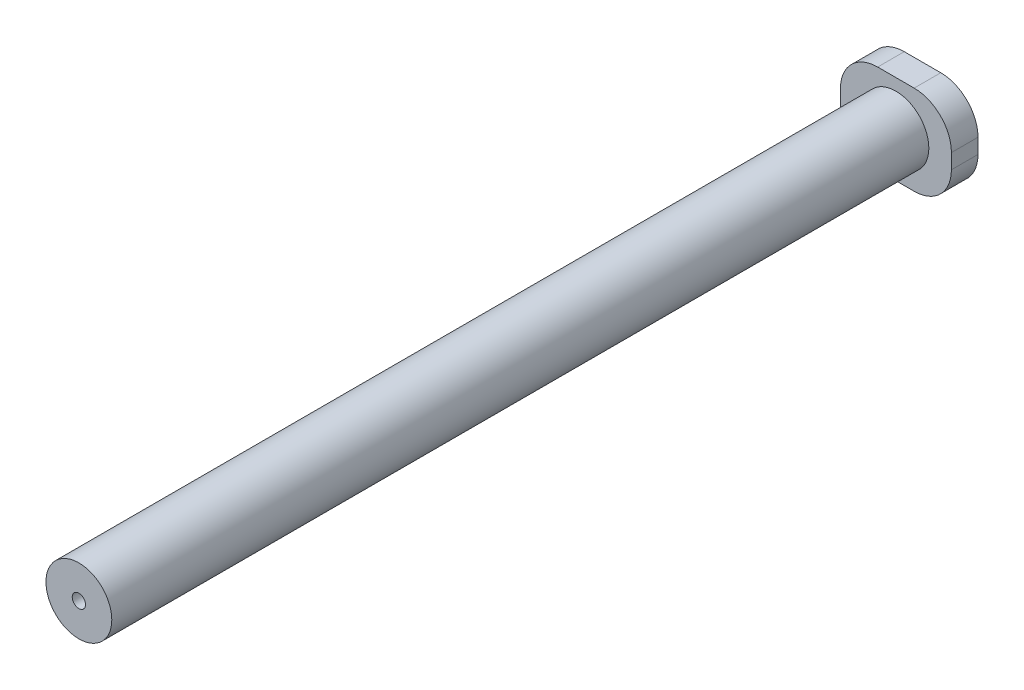
ISO-10303-21;
HEADER;
FILE_DESCRIPTION(('STEP AP214'),'2;1');
FILE_NAME('part.step','',(''),(''),'','','');
FILE_SCHEMA(('AUTOMOTIVE_DESIGN { 1 0 10303 214 1 1 1 1 }'));
ENDSEC;
DATA;
#1=APPLICATION_CONTEXT('core data for automotive mechanical design processes');
#2=APPLICATION_PROTOCOL_DEFINITION('international standard','automotive_design',2000,#1);
#3=PRODUCT_CONTEXT('',#1,'mechanical');
#4=PRODUCT('Part','Part','',(#3));
#5=PRODUCT_RELATED_PRODUCT_CATEGORY('part','',(#4));
#6=PRODUCT_DEFINITION_FORMATION('','',#4);
#7=PRODUCT_DEFINITION_CONTEXT('part definition',#1,'design');
#8=PRODUCT_DEFINITION('design','',#6,#7);
#9=PRODUCT_DEFINITION_SHAPE('','',#8);
#10=(LENGTH_UNIT() NAMED_UNIT(*) SI_UNIT(.MILLI.,.METRE.));
#11=(NAMED_UNIT(*) PLANE_ANGLE_UNIT() SI_UNIT($,.RADIAN.));
#12=(NAMED_UNIT(*) SI_UNIT($,.STERADIAN.) SOLID_ANGLE_UNIT());
#13=UNCERTAINTY_MEASURE_WITH_UNIT(LENGTH_MEASURE(1.E-05),#10,'distance_accuracy_value','');
#14=(GEOMETRIC_REPRESENTATION_CONTEXT(3) GLOBAL_UNCERTAINTY_ASSIGNED_CONTEXT((#13)) GLOBAL_UNIT_ASSIGNED_CONTEXT((#10,
#11,#12)) REPRESENTATION_CONTEXT('',''));
#15=CARTESIAN_POINT('',(0.,0.,0.));
#16=DIRECTION('',(0.,0.,1.));
#17=DIRECTION('',(1.,0.,0.));
#18=AXIS2_PLACEMENT_3D('',#15,#16,#17);
#19=CARTESIAN_POINT('',(0.,0.,3.175));
#20=DIRECTION('',(0.,1.,0.));
#21=DIRECTION('',(0.,0.,1.));
#22=AXIS2_PLACEMENT_3D('',#19,#20,#21);
#23=PLANE('',#22);
#24=DIRECTION('',(1.,0.,0.));
#25=VECTOR('',#24,1.);
#26=CARTESIAN_POINT('',(0.,0.,3.175));
#27=LINE('',#26,#25);
#28=CARTESIAN_POINT('',(4.445,0.,3.175));
#29=VERTEX_POINT('',#28);
#30=CARTESIAN_POINT('',(8.8011,0.,3.175));
#31=VERTEX_POINT('',#30);
#32=EDGE_CURVE('E124',#29,#31,#27,.T.);
#33=ORIENTED_EDGE('',*,*,#32,.F.);
#34=DIRECTION('',(0.,0.,-1.));
#35=VECTOR('',#34,1.);
#36=CARTESIAN_POINT('',(4.445,0.,0.));
#37=LINE('',#36,#35);
#38=CARTESIAN_POINT('',(4.445,0.,0.));
#39=VERTEX_POINT('',#38);
#40=EDGE_CURVE('E109',#29,#39,#37,.T.);
#41=ORIENTED_EDGE('',*,*,#40,.T.);
#42=DIRECTION('',(1.,0.,0.));
#43=VECTOR('',#42,1.);
#44=CARTESIAN_POINT('',(0.,0.,0.));
#45=LINE('',#44,#43);
#46=CARTESIAN_POINT('',(8.8011,0.,0.));
#47=VERTEX_POINT('',#46);
#48=EDGE_CURVE('E121',#39,#47,#45,.T.);
#49=ORIENTED_EDGE('',*,*,#48,.T.);
#50=DIRECTION('',(0.,0.,-1.));
#51=VECTOR('',#50,1.);
#52=CARTESIAN_POINT('',(8.8011,0.,3.175));
#53=LINE('',#52,#51);
#54=EDGE_CURVE('E126',#47,#31,#53,.F.);
#55=ORIENTED_EDGE('',*,*,#54,.T.);
#56=EDGE_LOOP('',(#33,#41,#49,#55));
#57=FACE_BOUND('',#56,.T.);
#58=ADVANCED_FACE('F39',(#57),#23,.F.);
#59=CARTESIAN_POINT('',(13.2461,0.,3.175));
#60=DIRECTION('',(-1.,0.,0.));
#61=DIRECTION('',(0.,0.,1.));
#62=AXIS2_PLACEMENT_3D('',#59,#60,#61);
#63=PLANE('',#62);
#64=DIRECTION('',(0.,1.,0.));
#65=VECTOR('',#64,1.);
#66=CARTESIAN_POINT('',(13.2461,0.,3.175));
#67=LINE('',#66,#65);
#68=CARTESIAN_POINT('',(13.2461,4.445,3.175));
#69=VERTEX_POINT('',#68);
#70=CARTESIAN_POINT('',(13.2461,6.223,3.175));
#71=VERTEX_POINT('',#70);
#72=EDGE_CURVE('E173',#69,#71,#67,.T.);
#73=ORIENTED_EDGE('',*,*,#72,.F.);
#74=DIRECTION('',(0.,0.,-1.));
#75=VECTOR('',#74,1.);
#76=CARTESIAN_POINT('',(13.2461,4.445,3.175));
#77=LINE('',#76,#75);
#78=CARTESIAN_POINT('',(13.2461,4.445,0.));
#79=VERTEX_POINT('',#78);
#80=EDGE_CURVE('E166',#69,#79,#77,.T.);
#81=ORIENTED_EDGE('',*,*,#80,.T.);
#82=DIRECTION('',(0.,1.,0.));
#83=VECTOR('',#82,1.);
#84=CARTESIAN_POINT('',(13.2461,0.,0.));
#85=LINE('',#84,#83);
#86=CARTESIAN_POINT('',(13.2461,6.223,0.));
#87=VERTEX_POINT('',#86);
#88=EDGE_CURVE('E131',#79,#87,#85,.T.);
#89=ORIENTED_EDGE('',*,*,#88,.T.);
#90=DIRECTION('',(0.,0.,-1.));
#91=VECTOR('',#90,1.);
#92=CARTESIAN_POINT('',(13.2461,6.223,3.175));
#93=LINE('',#92,#91);
#94=EDGE_CURVE('E164',#87,#71,#93,.F.);
#95=ORIENTED_EDGE('',*,*,#94,.T.);
#96=EDGE_LOOP('',(#73,#81,#89,#95));
#97=FACE_BOUND('',#96,.T.);
#98=ADVANCED_FACE('F171',(#97),#63,.F.);
#99=CARTESIAN_POINT('',(0.,10.668,3.175));
#100=DIRECTION('',(0.,1.,0.));
#101=DIRECTION('',(0.,0.,1.));
#102=AXIS2_PLACEMENT_3D('',#99,#100,#101);
#103=PLANE('',#102);
#104=DIRECTION('',(1.,0.,0.));
#105=VECTOR('',#104,1.);
#106=CARTESIAN_POINT('',(0.,10.668,3.175));
#107=LINE('',#106,#105);
#108=CARTESIAN_POINT('',(4.445,10.668,3.175));
#109=VERTEX_POINT('',#108);
#110=CARTESIAN_POINT('',(8.8011,10.668,3.175));
#111=VERTEX_POINT('',#110);
#112=EDGE_CURVE('E180',#109,#111,#107,.T.);
#113=ORIENTED_EDGE('',*,*,#112,.T.);
#114=DIRECTION('',(0.,0.,-1.));
#115=VECTOR('',#114,1.);
#116=CARTESIAN_POINT('',(8.8011,10.668,0.));
#117=LINE('',#116,#115);
#118=CARTESIAN_POINT('',(8.8011,10.668,0.));
#119=VERTEX_POINT('',#118);
#120=EDGE_CURVE('E11',#111,#119,#117,.T.);
#121=ORIENTED_EDGE('',*,*,#120,.T.);
#122=DIRECTION('',(1.,0.,0.));
#123=VECTOR('',#122,1.);
#124=CARTESIAN_POINT('',(0.,10.668,0.));
#125=LINE('',#124,#123);
#126=CARTESIAN_POINT('',(4.445,10.668,0.));
#127=VERTEX_POINT('',#126);
#128=EDGE_CURVE('E135',#127,#119,#125,.T.);
#129=ORIENTED_EDGE('',*,*,#128,.F.);
#130=DIRECTION('',(0.,0.,-1.));
#131=VECTOR('',#130,1.);
#132=CARTESIAN_POINT('',(4.445,10.668,3.175));
#133=LINE('',#132,#131);
#134=EDGE_CURVE('E47',#127,#109,#133,.F.);
#135=ORIENTED_EDGE('',*,*,#134,.T.);
#136=EDGE_LOOP('',(#113,#121,#129,#135));
#137=FACE_BOUND('',#136,.T.);
#138=ADVANCED_FACE('F179',(#137),#103,.T.);
#139=CARTESIAN_POINT('',(0.,0.,3.175));
#140=DIRECTION('',(-1.,0.,0.));
#141=DIRECTION('',(0.,0.,1.));
#142=AXIS2_PLACEMENT_3D('',#139,#140,#141);
#143=PLANE('',#142);
#144=DIRECTION('',(0.,1.,0.));
#145=VECTOR('',#144,1.);
#146=CARTESIAN_POINT('',(0.,0.,0.));
#147=LINE('',#146,#145);
#148=CARTESIAN_POINT('',(0.,4.445,0.));
#149=VERTEX_POINT('',#148);
#150=CARTESIAN_POINT('',(0.,6.223,0.));
#151=VERTEX_POINT('',#150);
#152=EDGE_CURVE('E146',#149,#151,#147,.T.);
#153=ORIENTED_EDGE('',*,*,#152,.F.);
#154=DIRECTION('',(0.,0.,-1.));
#155=VECTOR('',#154,1.);
#156=CARTESIAN_POINT('',(0.,4.445,3.175));
#157=LINE('',#156,#155);
#158=CARTESIAN_POINT('',(0.,4.445,3.175));
#159=VERTEX_POINT('',#158);
#160=EDGE_CURVE('E110',#149,#159,#157,.F.);
#161=ORIENTED_EDGE('',*,*,#160,.T.);
#162=DIRECTION('',(0.,1.,0.));
#163=VECTOR('',#162,1.);
#164=CARTESIAN_POINT('',(0.,0.,3.175));
#165=LINE('',#164,#163);
#166=CARTESIAN_POINT('',(0.,6.223,3.175));
#167=VERTEX_POINT('',#166);
#168=EDGE_CURVE('E141',#159,#167,#165,.T.);
#169=ORIENTED_EDGE('',*,*,#168,.T.);
#170=DIRECTION('',(0.,0.,-1.));
#171=VECTOR('',#170,1.);
#172=CARTESIAN_POINT('',(0.,6.223,3.175));
#173=LINE('',#172,#171);
#174=EDGE_CURVE('E115',#167,#151,#173,.T.);
#175=ORIENTED_EDGE('',*,*,#174,.T.);
#176=EDGE_LOOP('',(#153,#161,#169,#175));
#177=FACE_BOUND('',#176,.T.);
#178=ADVANCED_FACE('F234',(#177),#143,.T.);
#179=CARTESIAN_POINT('',(0.,0.,3.175));
#180=DIRECTION('',(0.,0.,1.));
#181=DIRECTION('',(1.,0.,0.));
#182=AXIS2_PLACEMENT_3D('',#179,#180,#181);
#183=PLANE('',#182);
#184=CARTESIAN_POINT('',(6.62305,5.334,3.175));
#185=DIRECTION('',(0.,0.,1.));
#186=DIRECTION('',(1.,0.,0.));
#187=AXIS2_PLACEMENT_3D('',#184,#185,#186);
#188=CIRCLE('',#187,3.93065);
#189=CARTESIAN_POINT('',(10.5537,5.334,3.175));
#190=VERTEX_POINT('',#189);
#191=EDGE_CURVE('E148',#190,#190,#188,.T.);
#192=ORIENTED_EDGE('',*,*,#191,.F.);
#193=EDGE_LOOP('',(#192));
#194=FACE_BOUND('',#193,.T.);
#195=ORIENTED_EDGE('',*,*,#168,.F.);
#196=CARTESIAN_POINT('',(4.445,4.445,3.175));
#197=DIRECTION('',(0.,0.,1.));
#198=DIRECTION('',(1.,0.,0.));
#199=AXIS2_PLACEMENT_3D('',#196,#197,#198);
#200=CIRCLE('',#199,4.445);
#201=EDGE_CURVE('E162',#159,#29,#200,.T.);
#202=ORIENTED_EDGE('',*,*,#201,.T.);
#203=ORIENTED_EDGE('',*,*,#32,.T.);
#204=CARTESIAN_POINT('',(8.8011,4.445,3.175));
#205=DIRECTION('',(0.,0.,1.));
#206=DIRECTION('',(1.,0.,0.));
#207=AXIS2_PLACEMENT_3D('',#204,#205,#206);
#208=CIRCLE('',#207,4.445);
#209=EDGE_CURVE('E160',#31,#69,#208,.T.);
#210=ORIENTED_EDGE('',*,*,#209,.T.);
#211=ORIENTED_EDGE('',*,*,#72,.T.);
#212=CARTESIAN_POINT('',(8.8011,6.223,3.175));
#213=DIRECTION('',(0.,0.,1.));
#214=DIRECTION('',(1.,0.,0.));
#215=AXIS2_PLACEMENT_3D('',#212,#213,#214);
#216=CIRCLE('',#215,4.445);
#217=EDGE_CURVE('E54',#71,#111,#216,.T.);
#218=ORIENTED_EDGE('',*,*,#217,.T.);
#219=ORIENTED_EDGE('',*,*,#112,.F.);
#220=CARTESIAN_POINT('',(4.445,6.223,3.175));
#221=DIRECTION('',(0.,0.,1.));
#222=DIRECTION('',(1.,0.,0.));
#223=AXIS2_PLACEMENT_3D('',#220,#221,#222);
#224=CIRCLE('',#223,4.445);
#225=EDGE_CURVE('E157',#109,#167,#224,.T.);
#226=ORIENTED_EDGE('',*,*,#225,.T.);
#227=EDGE_LOOP('',(#195,#202,#203,#210,#211,#218,#219,#226));
#228=FACE_BOUND('',#227,.T.);
#229=ADVANCED_FACE('F232',(#194,#228),#183,.T.);
#230=CARTESIAN_POINT('',(0.,0.,0.));
#231=DIRECTION('',(0.,0.,1.));
#232=DIRECTION('',(1.,0.,0.));
#233=AXIS2_PLACEMENT_3D('',#230,#231,#232);
#234=PLANE('',#233);
#235=ORIENTED_EDGE('',*,*,#48,.F.);
#236=CARTESIAN_POINT('',(4.445,4.445,0.));
#237=DIRECTION('',(0.,0.,1.));
#238=DIRECTION('',(1.,0.,0.));
#239=AXIS2_PLACEMENT_3D('',#236,#237,#238);
#240=CIRCLE('',#239,4.445);
#241=EDGE_CURVE('E105',#39,#149,#240,.F.);
#242=ORIENTED_EDGE('',*,*,#241,.T.);
#243=ORIENTED_EDGE('',*,*,#152,.T.);
#244=CARTESIAN_POINT('',(4.445,6.223,0.));
#245=DIRECTION('',(0.,0.,1.));
#246=DIRECTION('',(1.,0.,0.));
#247=AXIS2_PLACEMENT_3D('',#244,#245,#246);
#248=CIRCLE('',#247,4.445);
#249=EDGE_CURVE('E125',#151,#127,#248,.F.);
#250=ORIENTED_EDGE('',*,*,#249,.T.);
#251=ORIENTED_EDGE('',*,*,#128,.T.);
#252=CARTESIAN_POINT('',(8.8011,6.223,0.));
#253=DIRECTION('',(0.,0.,1.));
#254=DIRECTION('',(1.,0.,0.));
#255=AXIS2_PLACEMENT_3D('',#252,#253,#254);
#256=CIRCLE('',#255,4.445);
#257=EDGE_CURVE('E151',#119,#87,#256,.F.);
#258=ORIENTED_EDGE('',*,*,#257,.T.);
#259=ORIENTED_EDGE('',*,*,#88,.F.);
#260=CARTESIAN_POINT('',(8.8011,4.445,0.));
#261=DIRECTION('',(0.,0.,1.));
#262=DIRECTION('',(1.,0.,0.));
#263=AXIS2_PLACEMENT_3D('',#260,#261,#262);
#264=CIRCLE('',#263,4.445);
#265=EDGE_CURVE('E116',#79,#47,#264,.F.);
#266=ORIENTED_EDGE('',*,*,#265,.T.);
#267=EDGE_LOOP('',(#235,#242,#243,#250,#251,#258,#259,#266));
#268=FACE_BOUND('',#267,.T.);
#269=CARTESIAN_POINT('',(6.62305,5.334,0.));
#270=DIRECTION('',(0.,0.,1.));
#271=DIRECTION('',(1.,0.,0.));
#272=AXIS2_PLACEMENT_3D('',#269,#270,#271);
#273=CIRCLE('',#272,0.79375);
#274=CARTESIAN_POINT('',(7.4168,5.334,0.));
#275=VERTEX_POINT('',#274);
#276=EDGE_CURVE('E188',#275,#275,#273,.T.);
#277=ORIENTED_EDGE('',*,*,#276,.T.);
#278=EDGE_LOOP('',(#277));
#279=FACE_BOUND('',#278,.T.);
#280=ADVANCED_FACE('F128',(#268,#279),#234,.F.);
#281=CARTESIAN_POINT('',(6.62305,5.334,100.711));
#282=DIRECTION('',(0.,0.,-1.));
#283=DIRECTION('',(-1.,0.,0.));
#284=AXIS2_PLACEMENT_3D('',#281,#282,#283);
#285=CYLINDRICAL_SURFACE('',#284,0.79375);
#286=CARTESIAN_POINT('',(6.62305,5.334,100.711));
#287=DIRECTION('',(0.,0.,1.));
#288=DIRECTION('',(1.,0.,0.));
#289=AXIS2_PLACEMENT_3D('',#286,#287,#288);
#290=CIRCLE('',#289,0.79375);
#291=CARTESIAN_POINT('',(7.4168,5.334,100.711));
#292=VERTEX_POINT('',#291);
#293=EDGE_CURVE('E138',#292,#292,#290,.T.);
#294=ORIENTED_EDGE('',*,*,#293,.T.);
#295=EDGE_LOOP('',(#294));
#296=FACE_BOUND('',#295,.T.);
#297=ORIENTED_EDGE('',*,*,#276,.F.);
#298=EDGE_LOOP('',(#297));
#299=FACE_BOUND('',#298,.T.);
#300=ADVANCED_FACE('F194',(#296,#299),#285,.F.);
#301=CARTESIAN_POINT('',(6.62305,5.334,100.711));
#302=DIRECTION('',(0.,0.,-1.));
#303=DIRECTION('',(-1.,0.,0.));
#304=AXIS2_PLACEMENT_3D('',#301,#302,#303);
#305=CYLINDRICAL_SURFACE('',#304,3.93065);
#306=ORIENTED_EDGE('',*,*,#191,.T.);
#307=EDGE_LOOP('',(#306));
#308=FACE_BOUND('',#307,.T.);
#309=CARTESIAN_POINT('',(6.62305,5.334,100.711));
#310=DIRECTION('',(0.,0.,1.));
#311=DIRECTION('',(1.,0.,0.));
#312=AXIS2_PLACEMENT_3D('',#309,#310,#311);
#313=CIRCLE('',#312,3.93065);
#314=CARTESIAN_POINT('',(10.5537,5.334,100.711));
#315=VERTEX_POINT('',#314);
#316=EDGE_CURVE('E132',#315,#315,#313,.T.);
#317=ORIENTED_EDGE('',*,*,#316,.F.);
#318=EDGE_LOOP('',(#317));
#319=FACE_BOUND('',#318,.T.);
#320=ADVANCED_FACE('F200',(#308,#319),#305,.T.);
#321=CARTESIAN_POINT('',(0.,0.,100.711));
#322=DIRECTION('',(0.,0.,1.));
#323=DIRECTION('',(1.,0.,0.));
#324=AXIS2_PLACEMENT_3D('',#321,#322,#323);
#325=PLANE('',#324);
#326=ORIENTED_EDGE('',*,*,#293,.F.);
#327=EDGE_LOOP('',(#326));
#328=FACE_BOUND('',#327,.T.);
#329=ORIENTED_EDGE('',*,*,#316,.T.);
#330=EDGE_LOOP('',(#329));
#331=FACE_BOUND('',#330,.T.);
#332=ADVANCED_FACE('F197',(#328,#331),#325,.T.);
#333=CARTESIAN_POINT('',(4.445,4.445,3.175));
#334=DIRECTION('',(0.,0.,1.));
#335=DIRECTION('',(1.,0.,0.));
#336=AXIS2_PLACEMENT_3D('',#333,#334,#335);
#337=CYLINDRICAL_SURFACE('',#336,4.445);
#338=ORIENTED_EDGE('',*,*,#201,.F.);
#339=ORIENTED_EDGE('',*,*,#160,.F.);
#340=ORIENTED_EDGE('',*,*,#241,.F.);
#341=ORIENTED_EDGE('',*,*,#40,.F.);
#342=EDGE_LOOP('',(#338,#339,#340,#341));
#343=FACE_BOUND('',#342,.T.);
#344=ADVANCED_FACE('F108',(#343),#337,.T.);
#345=CARTESIAN_POINT('',(8.8011,4.445,3.175));
#346=DIRECTION('',(0.,0.,-1.));
#347=DIRECTION('',(-1.,0.,0.));
#348=AXIS2_PLACEMENT_3D('',#345,#346,#347);
#349=CYLINDRICAL_SURFACE('',#348,4.445);
#350=ORIENTED_EDGE('',*,*,#209,.F.);
#351=ORIENTED_EDGE('',*,*,#54,.F.);
#352=ORIENTED_EDGE('',*,*,#265,.F.);
#353=ORIENTED_EDGE('',*,*,#80,.F.);
#354=EDGE_LOOP('',(#350,#351,#352,#353));
#355=FACE_BOUND('',#354,.T.);
#356=ADVANCED_FACE('F221',(#355),#349,.T.);
#357=CARTESIAN_POINT('',(8.8011,6.223,3.175));
#358=DIRECTION('',(0.,0.,1.));
#359=DIRECTION('',(1.,0.,0.));
#360=AXIS2_PLACEMENT_3D('',#357,#358,#359);
#361=CYLINDRICAL_SURFACE('',#360,4.445);
#362=ORIENTED_EDGE('',*,*,#217,.F.);
#363=ORIENTED_EDGE('',*,*,#94,.F.);
#364=ORIENTED_EDGE('',*,*,#257,.F.);
#365=ORIENTED_EDGE('',*,*,#120,.F.);
#366=EDGE_LOOP('',(#362,#363,#364,#365));
#367=FACE_BOUND('',#366,.T.);
#368=ADVANCED_FACE('F178',(#367),#361,.T.);
#369=CARTESIAN_POINT('',(4.445,6.223,3.175));
#370=DIRECTION('',(0.,0.,-1.));
#371=DIRECTION('',(-1.,0.,0.));
#372=AXIS2_PLACEMENT_3D('',#369,#370,#371);
#373=CYLINDRICAL_SURFACE('',#372,4.445);
#374=ORIENTED_EDGE('',*,*,#225,.F.);
#375=ORIENTED_EDGE('',*,*,#134,.F.);
#376=ORIENTED_EDGE('',*,*,#249,.F.);
#377=ORIENTED_EDGE('',*,*,#174,.F.);
#378=EDGE_LOOP('',(#374,#375,#376,#377));
#379=FACE_BOUND('',#378,.T.);
#380=ADVANCED_FACE('F41',(#379),#373,.T.);
#381=CLOSED_SHELL('',(#58,#98,#138,#178,#229,#280,#300,#320,#332,#344,#356,#368,#380));
#382=MANIFOLD_SOLID_BREP('B2',#381);
#383=ADVANCED_BREP_SHAPE_REPRESENTATION('',(#18,#382),#14);
#384=SHAPE_DEFINITION_REPRESENTATION(#9,#383);
ENDSEC;
END-ISO-10303-21;
